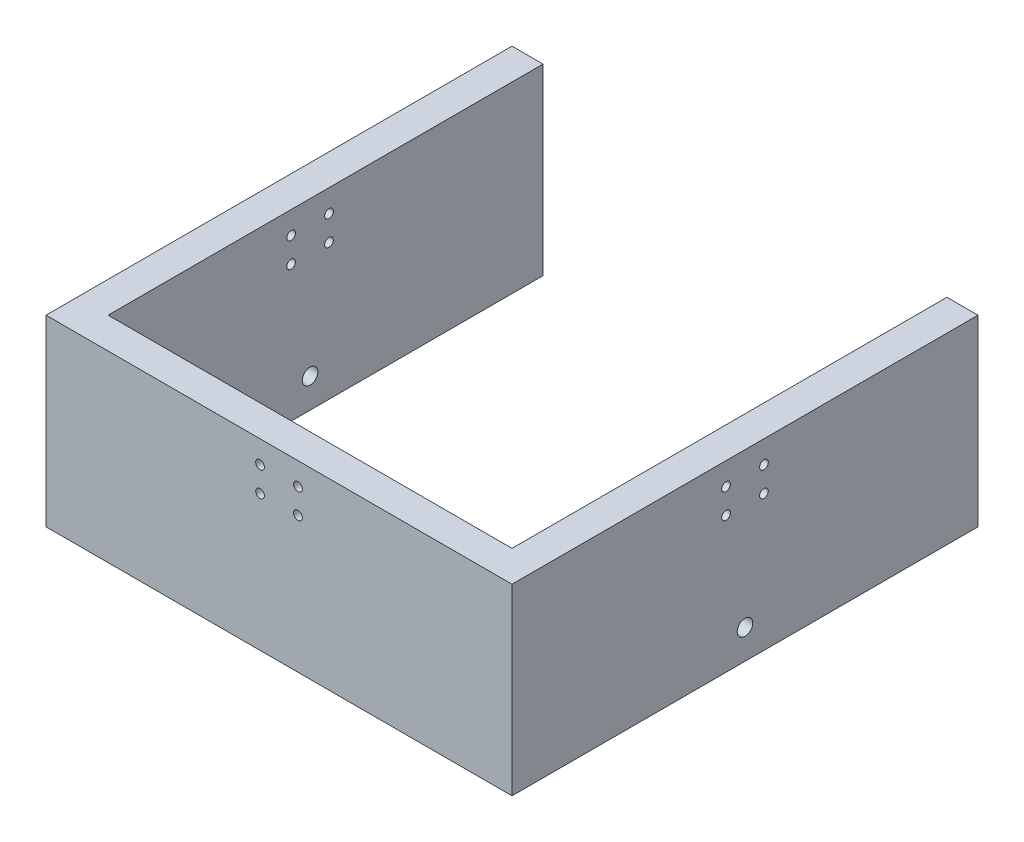
ISO-10303-21;
HEADER;
FILE_DESCRIPTION(('STEP AP214'),'2;1');
FILE_NAME('part.step','',(''),(''),'','','');
FILE_SCHEMA(('AUTOMOTIVE_DESIGN { 1 0 10303 214 1 1 1 1 }'));
ENDSEC;
DATA;
#1=APPLICATION_CONTEXT('core data for automotive mechanical design processes');
#2=APPLICATION_PROTOCOL_DEFINITION('international standard','automotive_design',2000,#1);
#3=PRODUCT_CONTEXT('',#1,'mechanical');
#4=PRODUCT('Part','Part','',(#3));
#5=PRODUCT_RELATED_PRODUCT_CATEGORY('part','',(#4));
#6=PRODUCT_DEFINITION_FORMATION('','',#4);
#7=PRODUCT_DEFINITION_CONTEXT('part definition',#1,'design');
#8=PRODUCT_DEFINITION('design','',#6,#7);
#9=PRODUCT_DEFINITION_SHAPE('','',#8);
#10=(LENGTH_UNIT() NAMED_UNIT(*) SI_UNIT(.MILLI.,.METRE.));
#11=(NAMED_UNIT(*) PLANE_ANGLE_UNIT() SI_UNIT($,.RADIAN.));
#12=(NAMED_UNIT(*) SI_UNIT($,.STERADIAN.) SOLID_ANGLE_UNIT());
#13=UNCERTAINTY_MEASURE_WITH_UNIT(LENGTH_MEASURE(1.E-05),#10,'distance_accuracy_value','');
#14=(GEOMETRIC_REPRESENTATION_CONTEXT(3) GLOBAL_UNCERTAINTY_ASSIGNED_CONTEXT((#13)) GLOBAL_UNIT_ASSIGNED_CONTEXT((#10,
#11,#12)) REPRESENTATION_CONTEXT('',''));
#15=CARTESIAN_POINT('',(0.,0.,0.));
#16=DIRECTION('',(0.,0.,1.));
#17=DIRECTION('',(1.,0.,0.));
#18=AXIS2_PLACEMENT_3D('',#15,#16,#17);
#19=CARTESIAN_POINT('',(-75.,-59.,-75.));
#20=DIRECTION('',(0.,0.,-1.));
#21=DIRECTION('',(-1.,0.,0.));
#22=AXIS2_PLACEMENT_3D('',#19,#20,#21);
#23=PLANE('',#22);
#24=DIRECTION('',(0.,1.,0.));
#25=VECTOR('',#24,1.);
#26=CARTESIAN_POINT('',(-65.,-59.,-75.));
#27=LINE('',#26,#25);
#28=CARTESIAN_POINT('',(-65.,-59.,-75.));
#29=VERTEX_POINT('',#28);
#30=CARTESIAN_POINT('',(-65.,0.,-75.));
#31=VERTEX_POINT('',#30);
#32=EDGE_CURVE('E132',#29,#31,#27,.T.);
#33=ORIENTED_EDGE('',*,*,#32,.F.);
#34=DIRECTION('',(-1.,0.,0.));
#35=VECTOR('',#34,1.);
#36=CARTESIAN_POINT('',(-75.,-59.,-75.));
#37=LINE('',#36,#35);
#38=CARTESIAN_POINT('',(-75.,-59.,-75.));
#39=VERTEX_POINT('',#38);
#40=EDGE_CURVE('E179',#29,#39,#37,.T.);
#41=ORIENTED_EDGE('',*,*,#40,.T.);
#42=DIRECTION('',(0.,1.,0.));
#43=VECTOR('',#42,1.);
#44=CARTESIAN_POINT('',(-75.,-59.,-75.));
#45=LINE('',#44,#43);
#46=CARTESIAN_POINT('',(-75.,0.,-75.));
#47=VERTEX_POINT('',#46);
#48=EDGE_CURVE('E144',#39,#47,#45,.T.);
#49=ORIENTED_EDGE('',*,*,#48,.T.);
#50=DIRECTION('',(-1.,0.,0.));
#51=VECTOR('',#50,1.);
#52=CARTESIAN_POINT('',(-75.,0.,-75.));
#53=LINE('',#52,#51);
#54=EDGE_CURVE('E122',#31,#47,#53,.T.);
#55=ORIENTED_EDGE('',*,*,#54,.F.);
#56=EDGE_LOOP('',(#33,#41,#49,#55));
#57=FACE_BOUND('',#56,.T.);
#58=ADVANCED_FACE('F43',(#57),#23,.T.);
#59=CARTESIAN_POINT('',(75.,-59.,75.));
#60=DIRECTION('',(1.,0.,0.));
#61=DIRECTION('',(0.,0.,-1.));
#62=AXIS2_PLACEMENT_3D('',#59,#60,#61);
#63=PLANE('',#62);
#64=CARTESIAN_POINT('',(75.,-49.5,0.));
#65=DIRECTION('',(1.,0.,0.));
#66=DIRECTION('',(0.,0.,-1.));
#67=AXIS2_PLACEMENT_3D('',#64,#65,#66);
#68=CIRCLE('',#67,2.5);
#69=CARTESIAN_POINT('',(75.,-49.5,-2.5));
#70=VERTEX_POINT('',#69);
#71=EDGE_CURVE('E302',#70,#70,#68,.T.);
#72=ORIENTED_EDGE('',*,*,#71,.F.);
#73=EDGE_LOOP('',(#72));
#74=FACE_BOUND('',#73,.T.);
#75=CARTESIAN_POINT('',(75.,-7.24999999999999,-6.1));
#76=DIRECTION('',(-1.,0.,0.));
#77=DIRECTION('',(0.,0.,1.));
#78=AXIS2_PLACEMENT_3D('',#75,#76,#77);
#79=CIRCLE('',#78,1.4);
#80=CARTESIAN_POINT('',(75.,-7.24999999999999,-4.7));
#81=VERTEX_POINT('',#80);
#82=EDGE_CURVE('E288',#81,#81,#79,.T.);
#83=ORIENTED_EDGE('',*,*,#82,.T.);
#84=EDGE_LOOP('',(#83));
#85=FACE_BOUND('',#84,.T.);
#86=CARTESIAN_POINT('',(75.,-15.25,6.1));
#87=DIRECTION('',(-1.,0.,0.));
#88=DIRECTION('',(0.,0.,1.));
#89=AXIS2_PLACEMENT_3D('',#86,#87,#88);
#90=CIRCLE('',#89,1.4);
#91=CARTESIAN_POINT('',(75.,-15.25,7.5));
#92=VERTEX_POINT('',#91);
#93=EDGE_CURVE('E140',#92,#92,#90,.T.);
#94=ORIENTED_EDGE('',*,*,#93,.T.);
#95=EDGE_LOOP('',(#94));
#96=FACE_BOUND('',#95,.T.);
#97=DIRECTION('',(0.,0.,-1.));
#98=VECTOR('',#97,1.);
#99=CARTESIAN_POINT('',(75.,0.,75.));
#100=LINE('',#99,#98);
#101=CARTESIAN_POINT('',(75.,0.,75.));
#102=VERTEX_POINT('',#101);
#103=CARTESIAN_POINT('',(75.,0.,-75.));
#104=VERTEX_POINT('',#103);
#105=EDGE_CURVE('E147',#102,#104,#100,.T.);
#106=ORIENTED_EDGE('',*,*,#105,.F.);
#107=DIRECTION('',(0.,1.,0.));
#108=VECTOR('',#107,1.);
#109=CARTESIAN_POINT('',(75.,-59.,75.));
#110=LINE('',#109,#108);
#111=CARTESIAN_POINT('',(75.,-59.,75.));
#112=VERTEX_POINT('',#111);
#113=EDGE_CURVE('E11',#112,#102,#110,.T.);
#114=ORIENTED_EDGE('',*,*,#113,.F.);
#115=DIRECTION('',(0.,0.,-1.));
#116=VECTOR('',#115,1.);
#117=CARTESIAN_POINT('',(75.,-59.,75.));
#118=LINE('',#117,#116);
#119=CARTESIAN_POINT('',(75.,-59.,-75.));
#120=VERTEX_POINT('',#119);
#121=EDGE_CURVE('E163',#112,#120,#118,.T.);
#122=ORIENTED_EDGE('',*,*,#121,.T.);
#123=DIRECTION('',(0.,1.,0.));
#124=VECTOR('',#123,1.);
#125=CARTESIAN_POINT('',(75.,-59.,-75.));
#126=LINE('',#125,#124);
#127=EDGE_CURVE('E89',#120,#104,#126,.T.);
#128=ORIENTED_EDGE('',*,*,#127,.T.);
#129=EDGE_LOOP('',(#106,#114,#122,#128));
#130=FACE_BOUND('',#129,.T.);
#131=CARTESIAN_POINT('',(75.,-15.25,-6.1));
#132=DIRECTION('',(1.,0.,0.));
#133=DIRECTION('',(0.,0.,-1.));
#134=AXIS2_PLACEMENT_3D('',#131,#132,#133);
#135=CIRCLE('',#134,1.4);
#136=CARTESIAN_POINT('',(75.,-15.25,-7.5));
#137=VERTEX_POINT('',#136);
#138=EDGE_CURVE('E280',#137,#137,#135,.T.);
#139=ORIENTED_EDGE('',*,*,#138,.F.);
#140=EDGE_LOOP('',(#139));
#141=FACE_BOUND('',#140,.T.);
#142=CARTESIAN_POINT('',(75.,-7.25,6.1));
#143=DIRECTION('',(1.,0.,0.));
#144=DIRECTION('',(0.,0.,-1.));
#145=AXIS2_PLACEMENT_3D('',#142,#143,#144);
#146=CIRCLE('',#145,1.4);
#147=CARTESIAN_POINT('',(75.,-7.25,4.7));
#148=VERTEX_POINT('',#147);
#149=EDGE_CURVE('E257',#148,#148,#146,.T.);
#150=ORIENTED_EDGE('',*,*,#149,.F.);
#151=EDGE_LOOP('',(#150));
#152=FACE_BOUND('',#151,.T.);
#153=ADVANCED_FACE('F45',(#74,#85,#96,#130,#141,#152),#63,.T.);
#154=CARTESIAN_POINT('',(-75.,-59.,75.));
#155=DIRECTION('',(0.,0.,1.));
#156=DIRECTION('',(1.,0.,0.));
#157=AXIS2_PLACEMENT_3D('',#154,#155,#156);
#158=PLANE('',#157);
#159=CARTESIAN_POINT('',(6.10000000000026,-7.24999999999999,75.));
#160=DIRECTION('',(0.,0.,-1.));
#161=DIRECTION('',(-1.,0.,0.));
#162=AXIS2_PLACEMENT_3D('',#159,#160,#161);
#163=CIRCLE('',#162,1.4);
#164=CARTESIAN_POINT('',(4.70000000000026,-7.24999999999999,75.));
#165=VERTEX_POINT('',#164);
#166=EDGE_CURVE('E250',#165,#165,#163,.T.);
#167=ORIENTED_EDGE('',*,*,#166,.T.);
#168=EDGE_LOOP('',(#167));
#169=FACE_BOUND('',#168,.T.);
#170=CARTESIAN_POINT('',(-6.09999999999974,-7.25,75.));
#171=DIRECTION('',(0.,0.,1.));
#172=DIRECTION('',(1.,0.,0.));
#173=AXIS2_PLACEMENT_3D('',#170,#171,#172);
#174=CIRCLE('',#173,1.4);
#175=CARTESIAN_POINT('',(-4.69999999999974,-7.25,75.));
#176=VERTEX_POINT('',#175);
#177=EDGE_CURVE('E233',#176,#176,#174,.T.);
#178=ORIENTED_EDGE('',*,*,#177,.F.);
#179=EDGE_LOOP('',(#178));
#180=FACE_BOUND('',#179,.T.);
#181=DIRECTION('',(1.,0.,0.));
#182=VECTOR('',#181,1.);
#183=CARTESIAN_POINT('',(-75.,0.,75.));
#184=LINE('',#183,#182);
#185=CARTESIAN_POINT('',(-75.,0.,75.));
#186=VERTEX_POINT('',#185);
#187=EDGE_CURVE('E160',#186,#102,#184,.T.);
#188=ORIENTED_EDGE('',*,*,#187,.F.);
#189=DIRECTION('',(0.,1.,0.));
#190=VECTOR('',#189,1.);
#191=CARTESIAN_POINT('',(-75.,-59.,75.));
#192=LINE('',#191,#190);
#193=CARTESIAN_POINT('',(-75.,-59.,75.));
#194=VERTEX_POINT('',#193);
#195=EDGE_CURVE('E54',#194,#186,#192,.T.);
#196=ORIENTED_EDGE('',*,*,#195,.F.);
#197=DIRECTION('',(1.,0.,0.));
#198=VECTOR('',#197,1.);
#199=CARTESIAN_POINT('',(-75.,-59.,75.));
#200=LINE('',#199,#198);
#201=EDGE_CURVE('E169',#194,#112,#200,.T.);
#202=ORIENTED_EDGE('',*,*,#201,.T.);
#203=ORIENTED_EDGE('',*,*,#113,.T.);
#204=EDGE_LOOP('',(#188,#196,#202,#203));
#205=FACE_BOUND('',#204,.T.);
#206=CARTESIAN_POINT('',(6.10000000000026,-15.25,75.));
#207=DIRECTION('',(0.,0.,1.));
#208=DIRECTION('',(1.,0.,0.));
#209=AXIS2_PLACEMENT_3D('',#206,#207,#208);
#210=CIRCLE('',#209,1.4);
#211=CARTESIAN_POINT('',(7.50000000000026,-15.25,75.));
#212=VERTEX_POINT('',#211);
#213=EDGE_CURVE('E241',#212,#212,#210,.T.);
#214=ORIENTED_EDGE('',*,*,#213,.F.);
#215=EDGE_LOOP('',(#214));
#216=FACE_BOUND('',#215,.T.);
#217=CARTESIAN_POINT('',(-6.09999999999973,-15.25,75.));
#218=DIRECTION('',(0.,0.,-1.));
#219=DIRECTION('',(-1.,0.,0.));
#220=AXIS2_PLACEMENT_3D('',#217,#218,#219);
#221=CIRCLE('',#220,1.4);
#222=CARTESIAN_POINT('',(-7.49999999999973,-15.25,75.));
#223=VERTEX_POINT('',#222);
#224=EDGE_CURVE('E266',#223,#223,#221,.T.);
#225=ORIENTED_EDGE('',*,*,#224,.T.);
#226=EDGE_LOOP('',(#225));
#227=FACE_BOUND('',#226,.T.);
#228=ADVANCED_FACE('F337',(#169,#180,#205,#216,#227),#158,.T.);
#229=CARTESIAN_POINT('',(65.,-59.,65.));
#230=DIRECTION('',(1.,0.,0.));
#231=DIRECTION('',(0.,0.,-1.));
#232=AXIS2_PLACEMENT_3D('',#229,#230,#231);
#233=PLANE('',#232);
#234=CARTESIAN_POINT('',(65.,-49.5,0.));
#235=DIRECTION('',(1.,0.,0.));
#236=DIRECTION('',(0.,0.,-1.));
#237=AXIS2_PLACEMENT_3D('',#234,#235,#236);
#238=CIRCLE('',#237,2.5);
#239=CARTESIAN_POINT('',(65.,-49.5,-2.5));
#240=VERTEX_POINT('',#239);
#241=EDGE_CURVE('E298',#240,#240,#238,.T.);
#242=ORIENTED_EDGE('',*,*,#241,.T.);
#243=EDGE_LOOP('',(#242));
#244=FACE_BOUND('',#243,.T.);
#245=CARTESIAN_POINT('',(65.,-15.25,-6.1));
#246=DIRECTION('',(1.,0.,0.));
#247=DIRECTION('',(0.,0.,-1.));
#248=AXIS2_PLACEMENT_3D('',#245,#246,#247);
#249=CIRCLE('',#248,1.4);
#250=CARTESIAN_POINT('',(65.,-15.25,-7.5));
#251=VERTEX_POINT('',#250);
#252=EDGE_CURVE('E284',#251,#251,#249,.T.);
#253=ORIENTED_EDGE('',*,*,#252,.T.);
#254=EDGE_LOOP('',(#253));
#255=FACE_BOUND('',#254,.T.);
#256=CARTESIAN_POINT('',(65.,-15.25,6.1));
#257=DIRECTION('',(-1.,0.,0.));
#258=DIRECTION('',(0.,0.,1.));
#259=AXIS2_PLACEMENT_3D('',#256,#257,#258);
#260=CIRCLE('',#259,1.4);
#261=CARTESIAN_POINT('',(65.,-15.25,7.5));
#262=VERTEX_POINT('',#261);
#263=EDGE_CURVE('E276',#262,#262,#260,.T.);
#264=ORIENTED_EDGE('',*,*,#263,.F.);
#265=EDGE_LOOP('',(#264));
#266=FACE_BOUND('',#265,.T.);
#267=DIRECTION('',(0.,0.,-1.));
#268=VECTOR('',#267,1.);
#269=CARTESIAN_POINT('',(65.,0.,65.));
#270=LINE('',#269,#268);
#271=CARTESIAN_POINT('',(65.,0.,65.));
#272=VERTEX_POINT('',#271);
#273=CARTESIAN_POINT('',(65.,0.,-75.));
#274=VERTEX_POINT('',#273);
#275=EDGE_CURVE('E129',#272,#274,#270,.T.);
#276=ORIENTED_EDGE('',*,*,#275,.T.);
#277=DIRECTION('',(0.,-1.,0.));
#278=VECTOR('',#277,1.);
#279=CARTESIAN_POINT('',(65.,-59.,-75.));
#280=LINE('',#279,#278);
#281=CARTESIAN_POINT('',(65.,-59.,-75.));
#282=VERTEX_POINT('',#281);
#283=EDGE_CURVE('E141',#274,#282,#280,.T.);
#284=ORIENTED_EDGE('',*,*,#283,.T.);
#285=DIRECTION('',(0.,0.,-1.));
#286=VECTOR('',#285,1.);
#287=CARTESIAN_POINT('',(65.,-59.,65.));
#288=LINE('',#287,#286);
#289=CARTESIAN_POINT('',(65.,-59.,65.));
#290=VERTEX_POINT('',#289);
#291=EDGE_CURVE('E189',#290,#282,#288,.T.);
#292=ORIENTED_EDGE('',*,*,#291,.F.);
#293=DIRECTION('',(0.,1.,0.));
#294=VECTOR('',#293,1.);
#295=CARTESIAN_POINT('',(65.,-59.,65.));
#296=LINE('',#295,#294);
#297=EDGE_CURVE('E154',#290,#272,#296,.T.);
#298=ORIENTED_EDGE('',*,*,#297,.T.);
#299=EDGE_LOOP('',(#276,#284,#292,#298));
#300=FACE_BOUND('',#299,.T.);
#301=CARTESIAN_POINT('',(65.,-7.24999999999999,-6.1));
#302=DIRECTION('',(-1.,0.,0.));
#303=DIRECTION('',(0.,0.,1.));
#304=AXIS2_PLACEMENT_3D('',#301,#302,#303);
#305=CIRCLE('',#304,1.4);
#306=CARTESIAN_POINT('',(65.,-7.24999999999999,-4.7));
#307=VERTEX_POINT('',#306);
#308=EDGE_CURVE('E262',#307,#307,#305,.T.);
#309=ORIENTED_EDGE('',*,*,#308,.F.);
#310=EDGE_LOOP('',(#309));
#311=FACE_BOUND('',#310,.T.);
#312=CARTESIAN_POINT('',(65.,-7.25,6.1));
#313=DIRECTION('',(1.,0.,0.));
#314=DIRECTION('',(0.,0.,-1.));
#315=AXIS2_PLACEMENT_3D('',#312,#313,#314);
#316=CIRCLE('',#315,1.4);
#317=CARTESIAN_POINT('',(65.,-7.25,4.7));
#318=VERTEX_POINT('',#317);
#319=EDGE_CURVE('E261',#318,#318,#316,.T.);
#320=ORIENTED_EDGE('',*,*,#319,.T.);
#321=EDGE_LOOP('',(#320));
#322=FACE_BOUND('',#321,.T.);
#323=ADVANCED_FACE('F407',(#244,#255,#266,#300,#311,#322),#233,.F.);
#324=CARTESIAN_POINT('',(-65.,-59.,65.));
#325=DIRECTION('',(0.,0.,1.));
#326=DIRECTION('',(1.,0.,0.));
#327=AXIS2_PLACEMENT_3D('',#324,#325,#326);
#328=PLANE('',#327);
#329=CARTESIAN_POINT('',(6.10000000000023,-15.25,65.));
#330=DIRECTION('',(0.,0.,1.));
#331=DIRECTION('',(1.,0.,0.));
#332=AXIS2_PLACEMENT_3D('',#329,#330,#331);
#333=CIRCLE('',#332,1.4);
#334=CARTESIAN_POINT('',(7.50000000000022,-15.25,65.));
#335=VERTEX_POINT('',#334);
#336=EDGE_CURVE('E245',#335,#335,#333,.T.);
#337=ORIENTED_EDGE('',*,*,#336,.T.);
#338=EDGE_LOOP('',(#337));
#339=FACE_BOUND('',#338,.T.);
#340=CARTESIAN_POINT('',(-6.09999999999977,-7.25,65.));
#341=DIRECTION('',(0.,0.,1.));
#342=DIRECTION('',(1.,0.,0.));
#343=AXIS2_PLACEMENT_3D('',#340,#341,#342);
#344=CIRCLE('',#343,1.4);
#345=CARTESIAN_POINT('',(-4.69999999999977,-7.25,65.));
#346=VERTEX_POINT('',#345);
#347=EDGE_CURVE('E214',#346,#346,#344,.T.);
#348=ORIENTED_EDGE('',*,*,#347,.T.);
#349=EDGE_LOOP('',(#348));
#350=FACE_BOUND('',#349,.T.);
#351=DIRECTION('',(1.,0.,0.));
#352=VECTOR('',#351,1.);
#353=CARTESIAN_POINT('',(-65.,0.,65.));
#354=LINE('',#353,#352);
#355=CARTESIAN_POINT('',(-65.,0.,65.));
#356=VERTEX_POINT('',#355);
#357=EDGE_CURVE('E126',#356,#272,#354,.T.);
#358=ORIENTED_EDGE('',*,*,#357,.T.);
#359=ORIENTED_EDGE('',*,*,#297,.F.);
#360=DIRECTION('',(1.,0.,0.));
#361=VECTOR('',#360,1.);
#362=CARTESIAN_POINT('',(-65.,-59.,65.));
#363=LINE('',#362,#361);
#364=CARTESIAN_POINT('',(-65.,-59.,65.));
#365=VERTEX_POINT('',#364);
#366=EDGE_CURVE('E185',#365,#290,#363,.T.);
#367=ORIENTED_EDGE('',*,*,#366,.F.);
#368=DIRECTION('',(0.,1.,0.));
#369=VECTOR('',#368,1.);
#370=CARTESIAN_POINT('',(-65.,-59.,65.));
#371=LINE('',#370,#369);
#372=EDGE_CURVE('E182',#365,#356,#371,.T.);
#373=ORIENTED_EDGE('',*,*,#372,.T.);
#374=EDGE_LOOP('',(#358,#359,#367,#373));
#375=FACE_BOUND('',#374,.T.);
#376=CARTESIAN_POINT('',(6.10000000000023,-7.24999999999999,65.));
#377=DIRECTION('',(0.,0.,-1.));
#378=DIRECTION('',(-1.,0.,0.));
#379=AXIS2_PLACEMENT_3D('',#376,#377,#378);
#380=CIRCLE('',#379,1.4);
#381=CARTESIAN_POINT('',(4.70000000000023,-7.24999999999999,65.));
#382=VERTEX_POINT('',#381);
#383=EDGE_CURVE('E237',#382,#382,#380,.T.);
#384=ORIENTED_EDGE('',*,*,#383,.F.);
#385=EDGE_LOOP('',(#384));
#386=FACE_BOUND('',#385,.T.);
#387=CARTESIAN_POINT('',(-6.09999999999977,-15.25,65.));
#388=DIRECTION('',(0.,0.,-1.));
#389=DIRECTION('',(-1.,0.,0.));
#390=AXIS2_PLACEMENT_3D('',#387,#388,#389);
#391=CIRCLE('',#390,1.4);
#392=CARTESIAN_POINT('',(-7.49999999999977,-15.25,65.));
#393=VERTEX_POINT('',#392);
#394=EDGE_CURVE('E246',#393,#393,#391,.T.);
#395=ORIENTED_EDGE('',*,*,#394,.F.);
#396=EDGE_LOOP('',(#395));
#397=FACE_BOUND('',#396,.T.);
#398=ADVANCED_FACE('F405',(#339,#350,#375,#386,#397),#328,.F.);
#399=CARTESIAN_POINT('',(-75.,-59.,75.));
#400=DIRECTION('',(-1.,0.,0.));
#401=DIRECTION('',(0.,0.,1.));
#402=AXIS2_PLACEMENT_3D('',#399,#400,#401);
#403=PLANE('',#402);
#404=CARTESIAN_POINT('',(-75.,-49.5,0.));
#405=DIRECTION('',(1.,0.,0.));
#406=DIRECTION('',(0.,0.,-1.));
#407=AXIS2_PLACEMENT_3D('',#404,#405,#406);
#408=CIRCLE('',#407,2.5);
#409=CARTESIAN_POINT('',(-75.,-49.5,-2.5));
#410=VERTEX_POINT('',#409);
#411=EDGE_CURVE('E306',#410,#410,#408,.T.);
#412=ORIENTED_EDGE('',*,*,#411,.T.);
#413=EDGE_LOOP('',(#412));
#414=FACE_BOUND('',#413,.T.);
#415=CARTESIAN_POINT('',(-75.,-7.24999999999999,6.1));
#416=DIRECTION('',(1.,0.,0.));
#417=DIRECTION('',(0.,0.,-1.));
#418=AXIS2_PLACEMENT_3D('',#415,#416,#417);
#419=CIRCLE('',#418,1.4);
#420=CARTESIAN_POINT('',(-75.,-7.24999999999999,4.7));
#421=VERTEX_POINT('',#420);
#422=EDGE_CURVE('E205',#421,#421,#419,.T.);
#423=ORIENTED_EDGE('',*,*,#422,.T.);
#424=EDGE_LOOP('',(#423));
#425=FACE_BOUND('',#424,.T.);
#426=CARTESIAN_POINT('',(-75.,-7.25,-6.1));
#427=DIRECTION('',(-1.,0.,0.));
#428=DIRECTION('',(0.,0.,1.));
#429=AXIS2_PLACEMENT_3D('',#426,#427,#428);
#430=CIRCLE('',#429,1.4);
#431=CARTESIAN_POINT('',(-75.,-7.25,-4.7));
#432=VERTEX_POINT('',#431);
#433=EDGE_CURVE('E201',#432,#432,#430,.T.);
#434=ORIENTED_EDGE('',*,*,#433,.F.);
#435=EDGE_LOOP('',(#434));
#436=FACE_BOUND('',#435,.T.);
#437=DIRECTION('',(0.,0.,1.));
#438=VECTOR('',#437,1.);
#439=CARTESIAN_POINT('',(-75.,0.,75.));
#440=LINE('',#439,#438);
#441=EDGE_CURVE('E152',#47,#186,#440,.T.);
#442=ORIENTED_EDGE('',*,*,#441,.F.);
#443=ORIENTED_EDGE('',*,*,#48,.F.);
#444=DIRECTION('',(0.,0.,1.));
#445=VECTOR('',#444,1.);
#446=CARTESIAN_POINT('',(-75.,-59.,75.));
#447=LINE('',#446,#445);
#448=EDGE_CURVE('E171',#39,#194,#447,.T.);
#449=ORIENTED_EDGE('',*,*,#448,.T.);
#450=ORIENTED_EDGE('',*,*,#195,.T.);
#451=EDGE_LOOP('',(#442,#443,#449,#450));
#452=FACE_BOUND('',#451,.T.);
#453=CARTESIAN_POINT('',(-75.,-15.25,6.1));
#454=DIRECTION('',(-1.,0.,0.));
#455=DIRECTION('',(0.,0.,1.));
#456=AXIS2_PLACEMENT_3D('',#453,#454,#455);
#457=CIRCLE('',#456,1.4);
#458=CARTESIAN_POINT('',(-75.,-15.25,7.5));
#459=VERTEX_POINT('',#458);
#460=EDGE_CURVE('E222',#459,#459,#457,.T.);
#461=ORIENTED_EDGE('',*,*,#460,.F.);
#462=EDGE_LOOP('',(#461));
#463=FACE_BOUND('',#462,.T.);
#464=CARTESIAN_POINT('',(-75.,-15.25,-6.1));
#465=DIRECTION('',(1.,0.,0.));
#466=DIRECTION('',(0.,0.,-1.));
#467=AXIS2_PLACEMENT_3D('',#464,#465,#466);
#468=CIRCLE('',#467,1.4);
#469=CARTESIAN_POINT('',(-75.,-15.25,-7.5));
#470=VERTEX_POINT('',#469);
#471=EDGE_CURVE('E213',#470,#470,#468,.T.);
#472=ORIENTED_EDGE('',*,*,#471,.T.);
#473=EDGE_LOOP('',(#472));
#474=FACE_BOUND('',#473,.T.);
#475=ADVANCED_FACE('F348',(#414,#425,#436,#452,#463,#474),#403,.T.);
#476=CARTESIAN_POINT('',(-65.,-59.,65.));
#477=DIRECTION('',(-1.,0.,0.));
#478=DIRECTION('',(0.,0.,1.));
#479=AXIS2_PLACEMENT_3D('',#476,#477,#478);
#480=PLANE('',#479);
#481=CARTESIAN_POINT('',(-65.,-49.5,0.));
#482=DIRECTION('',(-1.,0.,0.));
#483=DIRECTION('',(0.,0.,1.));
#484=AXIS2_PLACEMENT_3D('',#481,#482,#483);
#485=CIRCLE('',#484,2.5);
#486=CARTESIAN_POINT('',(-65.,-49.5,2.5));
#487=VERTEX_POINT('',#486);
#488=EDGE_CURVE('E47',#487,#487,#485,.T.);
#489=ORIENTED_EDGE('',*,*,#488,.T.);
#490=EDGE_LOOP('',(#489));
#491=FACE_BOUND('',#490,.T.);
#492=CARTESIAN_POINT('',(-65.,-15.25,6.1));
#493=DIRECTION('',(-1.,0.,0.));
#494=DIRECTION('',(0.,0.,1.));
#495=AXIS2_PLACEMENT_3D('',#492,#493,#494);
#496=CIRCLE('',#495,1.4);
#497=CARTESIAN_POINT('',(-65.,-15.25,7.5));
#498=VERTEX_POINT('',#497);
#499=EDGE_CURVE('E218',#498,#498,#496,.T.);
#500=ORIENTED_EDGE('',*,*,#499,.T.);
#501=EDGE_LOOP('',(#500));
#502=FACE_BOUND('',#501,.T.);
#503=CARTESIAN_POINT('',(-65.,-7.25,-6.1));
#504=DIRECTION('',(-1.,0.,0.));
#505=DIRECTION('',(0.,0.,1.));
#506=AXIS2_PLACEMENT_3D('',#503,#504,#505);
#507=CIRCLE('',#506,1.4);
#508=CARTESIAN_POINT('',(-65.,-7.25,-4.7));
#509=VERTEX_POINT('',#508);
#510=EDGE_CURVE('E193',#509,#509,#507,.T.);
#511=ORIENTED_EDGE('',*,*,#510,.T.);
#512=EDGE_LOOP('',(#511));
#513=FACE_BOUND('',#512,.T.);
#514=DIRECTION('',(0.,0.,1.));
#515=VECTOR('',#514,1.);
#516=CARTESIAN_POINT('',(-65.,0.,65.));
#517=LINE('',#516,#515);
#518=EDGE_CURVE('E118',#31,#356,#517,.T.);
#519=ORIENTED_EDGE('',*,*,#518,.T.);
#520=ORIENTED_EDGE('',*,*,#372,.F.);
#521=DIRECTION('',(0.,0.,1.));
#522=VECTOR('',#521,1.);
#523=CARTESIAN_POINT('',(-65.,-59.,65.));
#524=LINE('',#523,#522);
#525=EDGE_CURVE('E136',#29,#365,#524,.T.);
#526=ORIENTED_EDGE('',*,*,#525,.F.);
#527=ORIENTED_EDGE('',*,*,#32,.T.);
#528=EDGE_LOOP('',(#519,#520,#526,#527));
#529=FACE_BOUND('',#528,.T.);
#530=CARTESIAN_POINT('',(-65.,-7.24999999999999,6.1));
#531=DIRECTION('',(1.,0.,0.));
#532=DIRECTION('',(0.,0.,-1.));
#533=AXIS2_PLACEMENT_3D('',#530,#531,#532);
#534=CIRCLE('',#533,1.4);
#535=CARTESIAN_POINT('',(-65.,-7.24999999999999,4.7));
#536=VERTEX_POINT('',#535);
#537=EDGE_CURVE('E226',#536,#536,#534,.T.);
#538=ORIENTED_EDGE('',*,*,#537,.F.);
#539=EDGE_LOOP('',(#538));
#540=FACE_BOUND('',#539,.T.);
#541=CARTESIAN_POINT('',(-65.,-15.25,-6.1));
#542=DIRECTION('',(1.,0.,0.));
#543=DIRECTION('',(0.,0.,-1.));
#544=AXIS2_PLACEMENT_3D('',#541,#542,#543);
#545=CIRCLE('',#544,1.4);
#546=CARTESIAN_POINT('',(-65.,-15.25,-7.5));
#547=VERTEX_POINT('',#546);
#548=EDGE_CURVE('E209',#547,#547,#545,.T.);
#549=ORIENTED_EDGE('',*,*,#548,.F.);
#550=EDGE_LOOP('',(#549));
#551=FACE_BOUND('',#550,.T.);
#552=ADVANCED_FACE('F133',(#491,#502,#513,#529,#540,#551),#480,.F.);
#553=ORIENTED_EDGE('',*,*,#283,.F.);
#554=EDGE_CURVE('E146',#104,#274,#53,.T.);
#555=ORIENTED_EDGE('',*,*,#554,.F.);
#556=ORIENTED_EDGE('',*,*,#127,.F.);
#557=EDGE_CURVE('E174',#120,#282,#37,.T.);
#558=ORIENTED_EDGE('',*,*,#557,.T.);
#559=EDGE_LOOP('',(#553,#555,#556,#558));
#560=FACE_BOUND('',#559,.T.);
#561=ADVANCED_FACE('F333',(#560),#23,.T.);
#562=CARTESIAN_POINT('',(0.,-59.,0.));
#563=DIRECTION('',(0.,-1.,0.));
#564=DIRECTION('',(0.,0.,-1.));
#565=AXIS2_PLACEMENT_3D('',#562,#563,#564);
#566=PLANE('',#565);
#567=ORIENTED_EDGE('',*,*,#40,.F.);
#568=ORIENTED_EDGE('',*,*,#525,.T.);
#569=ORIENTED_EDGE('',*,*,#366,.T.);
#570=ORIENTED_EDGE('',*,*,#291,.T.);
#571=ORIENTED_EDGE('',*,*,#557,.F.);
#572=ORIENTED_EDGE('',*,*,#121,.F.);
#573=ORIENTED_EDGE('',*,*,#201,.F.);
#574=ORIENTED_EDGE('',*,*,#448,.F.);
#575=EDGE_LOOP('',(#567,#568,#569,#570,#571,#572,#573,#574));
#576=FACE_BOUND('',#575,.T.);
#577=ADVANCED_FACE('F341',(#576),#566,.T.);
#578=CARTESIAN_POINT('',(0.,0.,0.));
#579=DIRECTION('',(0.,-1.,0.));
#580=DIRECTION('',(0.,0.,-1.));
#581=AXIS2_PLACEMENT_3D('',#578,#579,#580);
#582=PLANE('',#581);
#583=ORIENTED_EDGE('',*,*,#518,.F.);
#584=ORIENTED_EDGE('',*,*,#54,.T.);
#585=ORIENTED_EDGE('',*,*,#441,.T.);
#586=ORIENTED_EDGE('',*,*,#187,.T.);
#587=ORIENTED_EDGE('',*,*,#105,.T.);
#588=ORIENTED_EDGE('',*,*,#554,.T.);
#589=ORIENTED_EDGE('',*,*,#275,.F.);
#590=ORIENTED_EDGE('',*,*,#357,.F.);
#591=EDGE_LOOP('',(#583,#584,#585,#586,#587,#588,#589,#590));
#592=FACE_BOUND('',#591,.T.);
#593=ADVANCED_FACE('F120',(#592),#582,.F.);
#594=CARTESIAN_POINT('',(-65.,-7.25,-6.1));
#595=DIRECTION('',(-1.,0.,0.));
#596=DIRECTION('',(0.,0.,1.));
#597=AXIS2_PLACEMENT_3D('',#594,#595,#596);
#598=CYLINDRICAL_SURFACE('',#597,1.4);
#599=ORIENTED_EDGE('',*,*,#510,.F.);
#600=EDGE_LOOP('',(#599));
#601=FACE_BOUND('',#600,.T.);
#602=ORIENTED_EDGE('',*,*,#433,.T.);
#603=EDGE_LOOP('',(#602));
#604=FACE_BOUND('',#603,.T.);
#605=ADVANCED_FACE('F394',(#601,#604),#598,.F.);
#606=CARTESIAN_POINT('',(-65.,-7.24999999999999,6.1));
#607=DIRECTION('',(-1.,0.,0.));
#608=DIRECTION('',(0.,0.,1.));
#609=AXIS2_PLACEMENT_3D('',#606,#607,#608);
#610=CYLINDRICAL_SURFACE('',#609,1.4);
#611=ORIENTED_EDGE('',*,*,#537,.T.);
#612=EDGE_LOOP('',(#611));
#613=FACE_BOUND('',#612,.T.);
#614=ORIENTED_EDGE('',*,*,#422,.F.);
#615=EDGE_LOOP('',(#614));
#616=FACE_BOUND('',#615,.T.);
#617=ADVANCED_FACE('F390',(#613,#616),#610,.F.);
#618=CARTESIAN_POINT('',(-65.,-15.25,6.1));
#619=DIRECTION('',(-1.,0.,0.));
#620=DIRECTION('',(0.,0.,1.));
#621=AXIS2_PLACEMENT_3D('',#618,#619,#620);
#622=CYLINDRICAL_SURFACE('',#621,1.4);
#623=ORIENTED_EDGE('',*,*,#499,.F.);
#624=EDGE_LOOP('',(#623));
#625=FACE_BOUND('',#624,.T.);
#626=ORIENTED_EDGE('',*,*,#460,.T.);
#627=EDGE_LOOP('',(#626));
#628=FACE_BOUND('',#627,.T.);
#629=ADVANCED_FACE('F393',(#625,#628),#622,.F.);
#630=CARTESIAN_POINT('',(-65.,-15.25,-6.1));
#631=DIRECTION('',(-1.,0.,0.));
#632=DIRECTION('',(0.,0.,1.));
#633=AXIS2_PLACEMENT_3D('',#630,#631,#632);
#634=CYLINDRICAL_SURFACE('',#633,1.4);
#635=ORIENTED_EDGE('',*,*,#548,.T.);
#636=EDGE_LOOP('',(#635));
#637=FACE_BOUND('',#636,.T.);
#638=ORIENTED_EDGE('',*,*,#471,.F.);
#639=EDGE_LOOP('',(#638));
#640=FACE_BOUND('',#639,.T.);
#641=ADVANCED_FACE('F388',(#637,#640),#634,.F.);
#642=CARTESIAN_POINT('',(-6.09999999999977,-7.25,65.));
#643=DIRECTION('',(0.,0.,1.));
#644=DIRECTION('',(1.,0.,0.));
#645=AXIS2_PLACEMENT_3D('',#642,#643,#644);
#646=CYLINDRICAL_SURFACE('',#645,1.4);
#647=ORIENTED_EDGE('',*,*,#347,.F.);
#648=EDGE_LOOP('',(#647));
#649=FACE_BOUND('',#648,.T.);
#650=ORIENTED_EDGE('',*,*,#177,.T.);
#651=EDGE_LOOP('',(#650));
#652=FACE_BOUND('',#651,.T.);
#653=ADVANCED_FACE('F381',(#649,#652),#646,.F.);
#654=CARTESIAN_POINT('',(6.10000000000023,-7.24999999999999,65.));
#655=DIRECTION('',(0.,0.,1.));
#656=DIRECTION('',(1.,0.,0.));
#657=AXIS2_PLACEMENT_3D('',#654,#655,#656);
#658=CYLINDRICAL_SURFACE('',#657,1.4);
#659=ORIENTED_EDGE('',*,*,#383,.T.);
#660=EDGE_LOOP('',(#659));
#661=FACE_BOUND('',#660,.T.);
#662=ORIENTED_EDGE('',*,*,#166,.F.);
#663=EDGE_LOOP('',(#662));
#664=FACE_BOUND('',#663,.T.);
#665=ADVANCED_FACE('F378',(#661,#664),#658,.F.);
#666=CARTESIAN_POINT('',(6.10000000000023,-15.25,65.));
#667=DIRECTION('',(0.,0.,1.));
#668=DIRECTION('',(1.,0.,0.));
#669=AXIS2_PLACEMENT_3D('',#666,#667,#668);
#670=CYLINDRICAL_SURFACE('',#669,1.4);
#671=ORIENTED_EDGE('',*,*,#336,.F.);
#672=EDGE_LOOP('',(#671));
#673=FACE_BOUND('',#672,.T.);
#674=ORIENTED_EDGE('',*,*,#213,.T.);
#675=EDGE_LOOP('',(#674));
#676=FACE_BOUND('',#675,.T.);
#677=ADVANCED_FACE('F375',(#673,#676),#670,.F.);
#678=CARTESIAN_POINT('',(-6.09999999999977,-15.25,65.));
#679=DIRECTION('',(0.,0.,1.));
#680=DIRECTION('',(1.,0.,0.));
#681=AXIS2_PLACEMENT_3D('',#678,#679,#680);
#682=CYLINDRICAL_SURFACE('',#681,1.4);
#683=ORIENTED_EDGE('',*,*,#394,.T.);
#684=EDGE_LOOP('',(#683));
#685=FACE_BOUND('',#684,.T.);
#686=ORIENTED_EDGE('',*,*,#224,.F.);
#687=EDGE_LOOP('',(#686));
#688=FACE_BOUND('',#687,.T.);
#689=ADVANCED_FACE('F369',(#685,#688),#682,.F.);
#690=CARTESIAN_POINT('',(65.,-15.25,6.1));
#691=DIRECTION('',(1.,0.,0.));
#692=DIRECTION('',(0.,0.,-1.));
#693=AXIS2_PLACEMENT_3D('',#690,#691,#692);
#694=CYLINDRICAL_SURFACE('',#693,1.4);
#695=ORIENTED_EDGE('',*,*,#263,.T.);
#696=EDGE_LOOP('',(#695));
#697=FACE_BOUND('',#696,.T.);
#698=ORIENTED_EDGE('',*,*,#93,.F.);
#699=EDGE_LOOP('',(#698));
#700=FACE_BOUND('',#699,.T.);
#701=ADVANCED_FACE('F361',(#697,#700),#694,.F.);
#702=CARTESIAN_POINT('',(65.,-15.25,-6.1));
#703=DIRECTION('',(1.,0.,0.));
#704=DIRECTION('',(0.,0.,-1.));
#705=AXIS2_PLACEMENT_3D('',#702,#703,#704);
#706=CYLINDRICAL_SURFACE('',#705,1.4);
#707=ORIENTED_EDGE('',*,*,#252,.F.);
#708=EDGE_LOOP('',(#707));
#709=FACE_BOUND('',#708,.T.);
#710=ORIENTED_EDGE('',*,*,#138,.T.);
#711=EDGE_LOOP('',(#710));
#712=FACE_BOUND('',#711,.T.);
#713=ADVANCED_FACE('F359',(#709,#712),#706,.F.);
#714=CARTESIAN_POINT('',(65.,-7.24999999999999,-6.1));
#715=DIRECTION('',(1.,0.,0.));
#716=DIRECTION('',(0.,0.,-1.));
#717=AXIS2_PLACEMENT_3D('',#714,#715,#716);
#718=CYLINDRICAL_SURFACE('',#717,1.4);
#719=ORIENTED_EDGE('',*,*,#308,.T.);
#720=EDGE_LOOP('',(#719));
#721=FACE_BOUND('',#720,.T.);
#722=ORIENTED_EDGE('',*,*,#82,.F.);
#723=EDGE_LOOP('',(#722));
#724=FACE_BOUND('',#723,.T.);
#725=ADVANCED_FACE('F328',(#721,#724),#718,.F.);
#726=CARTESIAN_POINT('',(65.,-7.25,6.1));
#727=DIRECTION('',(1.,0.,0.));
#728=DIRECTION('',(0.,0.,-1.));
#729=AXIS2_PLACEMENT_3D('',#726,#727,#728);
#730=CYLINDRICAL_SURFACE('',#729,1.4);
#731=ORIENTED_EDGE('',*,*,#319,.F.);
#732=EDGE_LOOP('',(#731));
#733=FACE_BOUND('',#732,.T.);
#734=ORIENTED_EDGE('',*,*,#149,.T.);
#735=EDGE_LOOP('',(#734));
#736=FACE_BOUND('',#735,.T.);
#737=ADVANCED_FACE('F320',(#733,#736),#730,.F.);
#738=CARTESIAN_POINT('',(-75.,-49.5,0.));
#739=DIRECTION('',(1.,0.,0.));
#740=DIRECTION('',(0.,0.,-1.));
#741=AXIS2_PLACEMENT_3D('',#738,#739,#740);
#742=CYLINDRICAL_SURFACE('',#741,2.5);
#743=ORIENTED_EDGE('',*,*,#411,.F.);
#744=EDGE_LOOP('',(#743));
#745=FACE_BOUND('',#744,.T.);
#746=ORIENTED_EDGE('',*,*,#488,.F.);
#747=EDGE_LOOP('',(#746));
#748=FACE_BOUND('',#747,.T.);
#749=ADVANCED_FACE('F317',(#745,#748),#742,.F.);
#750=ORIENTED_EDGE('',*,*,#71,.T.);
#751=EDGE_LOOP('',(#750));
#752=FACE_BOUND('',#751,.T.);
#753=ORIENTED_EDGE('',*,*,#241,.F.);
#754=EDGE_LOOP('',(#753));
#755=FACE_BOUND('',#754,.T.);
#756=ADVANCED_FACE('F319',(#752,#755),#742,.F.);
#757=CLOSED_SHELL('',(#58,#153,#228,#323,#398,#475,#552,#561,#577,#593,#605,#617,#629,#641,#653,
#665,#677,#689,#701,#713,#725,#737,#749,#756));
#758=MANIFOLD_SOLID_BREP('B2',#757);
#759=ADVANCED_BREP_SHAPE_REPRESENTATION('',(#18,#758),#14);
#760=SHAPE_DEFINITION_REPRESENTATION(#9,#759);
ENDSEC;
END-ISO-10303-21;
